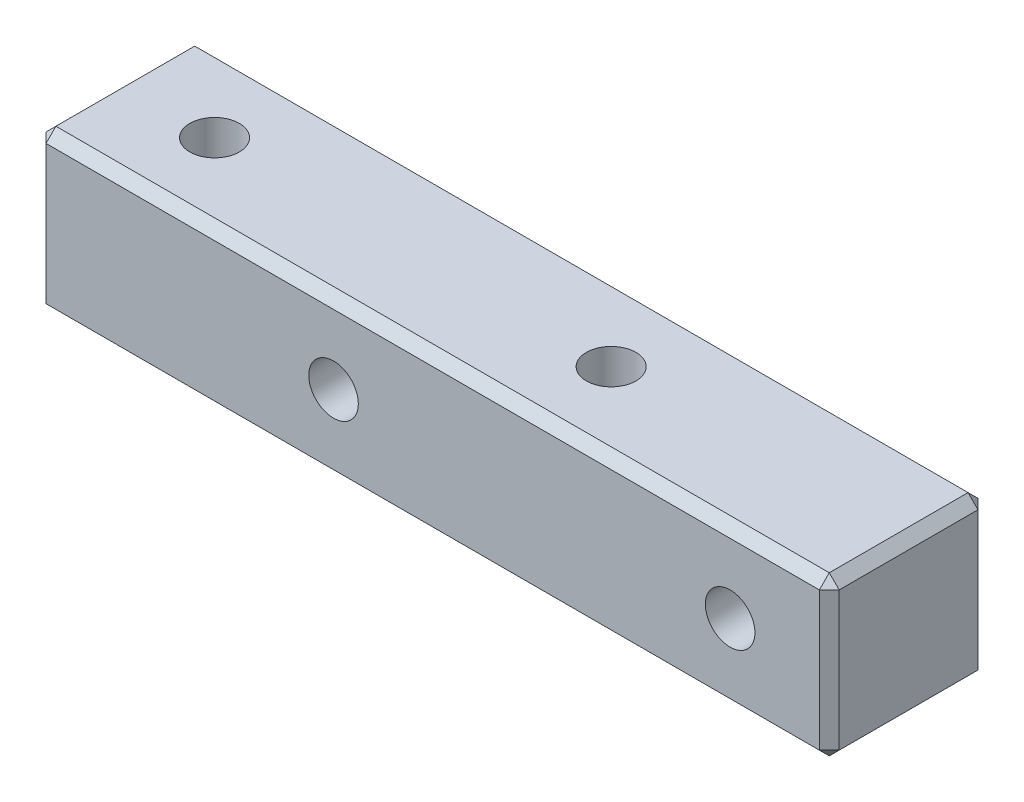
ISO-10303-21;
HEADER;
FILE_DESCRIPTION(('STEP AP214'),'2;1');
FILE_NAME('part.step','',(''),(''),'','','');
FILE_SCHEMA(('AUTOMOTIVE_DESIGN { 1 0 10303 214 1 1 1 1 }'));
ENDSEC;
DATA;
#1=APPLICATION_CONTEXT('core data for automotive mechanical design processes');
#2=APPLICATION_PROTOCOL_DEFINITION('international standard','automotive_design',2000,#1);
#3=PRODUCT_CONTEXT('',#1,'mechanical');
#4=PRODUCT('Part','Part','',(#3));
#5=PRODUCT_RELATED_PRODUCT_CATEGORY('part','',(#4));
#6=PRODUCT_DEFINITION_FORMATION('','',#4);
#7=PRODUCT_DEFINITION_CONTEXT('part definition',#1,'design');
#8=PRODUCT_DEFINITION('design','',#6,#7);
#9=PRODUCT_DEFINITION_SHAPE('','',#8);
#10=(LENGTH_UNIT() NAMED_UNIT(*) SI_UNIT(.MILLI.,.METRE.));
#11=(NAMED_UNIT(*) PLANE_ANGLE_UNIT() SI_UNIT($,.RADIAN.));
#12=(NAMED_UNIT(*) SI_UNIT($,.STERADIAN.) SOLID_ANGLE_UNIT());
#13=UNCERTAINTY_MEASURE_WITH_UNIT(LENGTH_MEASURE(1.E-05),#10,'distance_accuracy_value','');
#14=(GEOMETRIC_REPRESENTATION_CONTEXT(3) GLOBAL_UNCERTAINTY_ASSIGNED_CONTEXT((#13)) GLOBAL_UNIT_ASSIGNED_CONTEXT((#10,
#11,#12)) REPRESENTATION_CONTEXT('',''));
#15=CARTESIAN_POINT('',(0.,0.,0.));
#16=DIRECTION('',(0.,0.,1.));
#17=DIRECTION('',(1.,0.,0.));
#18=AXIS2_PLACEMENT_3D('',#15,#16,#17);
#19=CARTESIAN_POINT('',(0.,0.,-4.));
#20=DIRECTION('',(0.,0.,-1.));
#21=DIRECTION('',(-1.,0.,0.));
#22=AXIS2_PLACEMENT_3D('',#19,#20,#21);
#23=PLANE('',#22);
#24=DIRECTION('',(-1.,0.,0.));
#25=VECTOR('',#24,1.);
#26=CARTESIAN_POINT('',(-35.,-3.50000000000001,-4.));
#27=LINE('',#26,#25);
#28=CARTESIAN_POINT('',(4.5,-3.5,-4.));
#29=VERTEX_POINT('',#28);
#30=CARTESIAN_POINT('',(-34.5,-3.50000000000001,-4.));
#31=VERTEX_POINT('',#30);
#32=EDGE_CURVE('E197',#29,#31,#27,.T.);
#33=ORIENTED_EDGE('',*,*,#32,.T.);
#34=DIRECTION('',(0.,1.,0.));
#35=VECTOR('',#34,1.);
#36=CARTESIAN_POINT('',(-34.5,4.,-4.));
#37=LINE('',#36,#35);
#38=CARTESIAN_POINT('',(-34.5,3.5,-4.));
#39=VERTEX_POINT('',#38);
#40=EDGE_CURVE('E199',#31,#39,#37,.T.);
#41=ORIENTED_EDGE('',*,*,#40,.T.);
#42=DIRECTION('',(1.,0.,0.));
#43=VECTOR('',#42,1.);
#44=CARTESIAN_POINT('',(5.,3.5,-4.));
#45=LINE('',#44,#43);
#46=CARTESIAN_POINT('',(4.5,3.5,-4.));
#47=VERTEX_POINT('',#46);
#48=EDGE_CURVE('E193',#39,#47,#45,.T.);
#49=ORIENTED_EDGE('',*,*,#48,.T.);
#50=DIRECTION('',(0.,-1.,0.));
#51=VECTOR('',#50,1.);
#52=CARTESIAN_POINT('',(4.5,-4.,-4.));
#53=LINE('',#52,#51);
#54=EDGE_CURVE('E195',#47,#29,#53,.T.);
#55=ORIENTED_EDGE('',*,*,#54,.T.);
#56=EDGE_LOOP('',(#33,#41,#49,#55));
#57=FACE_BOUND('',#56,.T.);
#58=CARTESIAN_POINT('',(0.,0.,-4.));
#59=DIRECTION('',(0.,0.,1.));
#60=DIRECTION('',(1.,0.,0.));
#61=AXIS2_PLACEMENT_3D('',#58,#59,#60);
#62=CIRCLE('',#61,1.25);
#63=CARTESIAN_POINT('',(1.25,0.,-4.));
#64=VERTEX_POINT('',#63);
#65=EDGE_CURVE('E283',#64,#64,#62,.T.);
#66=ORIENTED_EDGE('',*,*,#65,.T.);
#67=EDGE_LOOP('',(#66));
#68=FACE_BOUND('',#67,.T.);
#69=CARTESIAN_POINT('',(-20.,0.,-4.));
#70=DIRECTION('',(0.,0.,1.));
#71=DIRECTION('',(1.,0.,0.));
#72=AXIS2_PLACEMENT_3D('',#69,#70,#71);
#73=CIRCLE('',#72,1.25);
#74=CARTESIAN_POINT('',(-18.75,0.,-4.));
#75=VERTEX_POINT('',#74);
#76=EDGE_CURVE('E158',#75,#75,#73,.T.);
#77=ORIENTED_EDGE('',*,*,#76,.T.);
#78=EDGE_LOOP('',(#77));
#79=FACE_BOUND('',#78,.T.);
#80=ADVANCED_FACE('F37',(#57,#68,#79),#23,.T.);
#81=CARTESIAN_POINT('',(0.,0.,4.));
#82=DIRECTION('',(0.,0.,-1.));
#83=DIRECTION('',(-1.,0.,0.));
#84=AXIS2_PLACEMENT_3D('',#81,#82,#83);
#85=PLANE('',#84);
#86=DIRECTION('',(-1.,0.,0.));
#87=VECTOR('',#86,1.);
#88=CARTESIAN_POINT('',(0.,3.5,4.));
#89=LINE('',#88,#87);
#90=CARTESIAN_POINT('',(4.5,3.5,4.));
#91=VERTEX_POINT('',#90);
#92=CARTESIAN_POINT('',(-34.5,3.5,4.));
#93=VERTEX_POINT('',#92);
#94=EDGE_CURVE('E175',#91,#93,#89,.T.);
#95=ORIENTED_EDGE('',*,*,#94,.T.);
#96=DIRECTION('',(0.,-1.,0.));
#97=VECTOR('',#96,1.);
#98=CARTESIAN_POINT('',(-34.5,0.,4.));
#99=LINE('',#98,#97);
#100=CARTESIAN_POINT('',(-34.5,-3.50000000000001,4.));
#101=VERTEX_POINT('',#100);
#102=EDGE_CURVE('E181',#93,#101,#99,.T.);
#103=ORIENTED_EDGE('',*,*,#102,.T.);
#104=DIRECTION('',(1.,0.,0.));
#105=VECTOR('',#104,1.);
#106=CARTESIAN_POINT('',(0.,-3.5,4.));
#107=LINE('',#106,#105);
#108=CARTESIAN_POINT('',(4.5,-3.5,4.));
#109=VERTEX_POINT('',#108);
#110=EDGE_CURVE('E179',#101,#109,#107,.T.);
#111=ORIENTED_EDGE('',*,*,#110,.T.);
#112=DIRECTION('',(0.,1.,0.));
#113=VECTOR('',#112,1.);
#114=CARTESIAN_POINT('',(4.5,0.,4.));
#115=LINE('',#114,#113);
#116=EDGE_CURVE('E177',#109,#91,#115,.T.);
#117=ORIENTED_EDGE('',*,*,#116,.T.);
#118=EDGE_LOOP('',(#95,#103,#111,#117));
#119=FACE_BOUND('',#118,.T.);
#120=CARTESIAN_POINT('',(0.,0.,4.));
#121=DIRECTION('',(0.,0.,1.));
#122=DIRECTION('',(1.,0.,0.));
#123=AXIS2_PLACEMENT_3D('',#120,#121,#122);
#124=CIRCLE('',#123,1.25);
#125=CARTESIAN_POINT('',(1.25,0.,4.));
#126=VERTEX_POINT('',#125);
#127=EDGE_CURVE('E280',#126,#126,#124,.T.);
#128=ORIENTED_EDGE('',*,*,#127,.F.);
#129=EDGE_LOOP('',(#128));
#130=FACE_BOUND('',#129,.T.);
#131=CARTESIAN_POINT('',(-20.,0.,4.));
#132=DIRECTION('',(0.,0.,1.));
#133=DIRECTION('',(1.,0.,0.));
#134=AXIS2_PLACEMENT_3D('',#131,#132,#133);
#135=CIRCLE('',#134,1.25);
#136=CARTESIAN_POINT('',(-18.75,0.,4.));
#137=VERTEX_POINT('',#136);
#138=EDGE_CURVE('E286',#137,#137,#135,.T.);
#139=ORIENTED_EDGE('',*,*,#138,.F.);
#140=EDGE_LOOP('',(#139));
#141=FACE_BOUND('',#140,.T.);
#142=ADVANCED_FACE('F343',(#119,#130,#141),#85,.F.);
#143=CARTESIAN_POINT('',(-35.,4.,4.));
#144=DIRECTION('',(0.,-1.,0.));
#145=DIRECTION('',(0.,0.,-1.));
#146=AXIS2_PLACEMENT_3D('',#143,#144,#145);
#147=PLANE('',#146);
#148=DIRECTION('',(-1.,0.,0.));
#149=VECTOR('',#148,1.);
#150=CARTESIAN_POINT('',(-35.,4.,-3.5));
#151=LINE('',#150,#149);
#152=CARTESIAN_POINT('',(4.5,4.,-3.5));
#153=VERTEX_POINT('',#152);
#154=CARTESIAN_POINT('',(-34.5,4.,-3.5));
#155=VERTEX_POINT('',#154);
#156=EDGE_CURVE('E172',#153,#155,#151,.T.);
#157=ORIENTED_EDGE('',*,*,#156,.T.);
#158=DIRECTION('',(0.,0.,1.));
#159=VECTOR('',#158,1.);
#160=CARTESIAN_POINT('',(-34.5,4.,4.));
#161=LINE('',#160,#159);
#162=CARTESIAN_POINT('',(-34.5,4.,3.5));
#163=VERTEX_POINT('',#162);
#164=EDGE_CURVE('E135',#155,#163,#161,.T.);
#165=ORIENTED_EDGE('',*,*,#164,.T.);
#166=DIRECTION('',(1.,0.,0.));
#167=VECTOR('',#166,1.);
#168=CARTESIAN_POINT('',(-35.,4.,3.5));
#169=LINE('',#168,#167);
#170=CARTESIAN_POINT('',(4.5,4.,3.5));
#171=VERTEX_POINT('',#170);
#172=EDGE_CURVE('E164',#163,#171,#169,.T.);
#173=ORIENTED_EDGE('',*,*,#172,.T.);
#174=DIRECTION('',(0.,0.,-1.));
#175=VECTOR('',#174,1.);
#176=CARTESIAN_POINT('',(4.5,4.,4.));
#177=LINE('',#176,#175);
#178=EDGE_CURVE('E166',#171,#153,#177,.T.);
#179=ORIENTED_EDGE('',*,*,#178,.T.);
#180=EDGE_LOOP('',(#157,#165,#173,#179));
#181=FACE_BOUND('',#180,.T.);
#182=CARTESIAN_POINT('',(-10.,4.,0.));
#183=DIRECTION('',(0.,1.,0.));
#184=DIRECTION('',(0.,0.,1.));
#185=AXIS2_PLACEMENT_3D('',#182,#183,#184);
#186=CIRCLE('',#185,1.25);
#187=CARTESIAN_POINT('',(-10.,4.,1.25));
#188=VERTEX_POINT('',#187);
#189=EDGE_CURVE('E261',#188,#188,#186,.T.);
#190=ORIENTED_EDGE('',*,*,#189,.F.);
#191=EDGE_LOOP('',(#190));
#192=FACE_BOUND('',#191,.T.);
#193=CARTESIAN_POINT('',(-30.,4.,0.));
#194=DIRECTION('',(0.,1.,0.));
#195=DIRECTION('',(0.,0.,1.));
#196=AXIS2_PLACEMENT_3D('',#193,#194,#195);
#197=CIRCLE('',#196,1.25);
#198=CARTESIAN_POINT('',(-30.,4.,1.25));
#199=VERTEX_POINT('',#198);
#200=EDGE_CURVE('E272',#199,#199,#197,.T.);
#201=ORIENTED_EDGE('',*,*,#200,.F.);
#202=EDGE_LOOP('',(#201));
#203=FACE_BOUND('',#202,.T.);
#204=ADVANCED_FACE('F314',(#181,#192,#203),#147,.F.);
#205=CARTESIAN_POINT('',(-35.,4.,4.));
#206=DIRECTION('',(1.,0.,0.));
#207=DIRECTION('',(0.,0.,-1.));
#208=AXIS2_PLACEMENT_3D('',#205,#206,#207);
#209=PLANE('',#208);
#210=DIRECTION('',(0.,1.,0.));
#211=VECTOR('',#210,1.);
#212=CARTESIAN_POINT('',(-35.,4.,3.5));
#213=LINE('',#212,#211);
#214=CARTESIAN_POINT('',(-35.,-3.50000000000001,3.5));
#215=VERTEX_POINT('',#214);
#216=CARTESIAN_POINT('',(-35.,3.5,3.5));
#217=VERTEX_POINT('',#216);
#218=EDGE_CURVE('E162',#215,#217,#213,.T.);
#219=ORIENTED_EDGE('',*,*,#218,.T.);
#220=DIRECTION('',(0.,0.,-1.));
#221=VECTOR('',#220,1.);
#222=CARTESIAN_POINT('',(-35.,3.5,4.));
#223=LINE('',#222,#221);
#224=CARTESIAN_POINT('',(-35.,3.5,-3.5));
#225=VERTEX_POINT('',#224);
#226=EDGE_CURVE('E133',#217,#225,#223,.T.);
#227=ORIENTED_EDGE('',*,*,#226,.T.);
#228=DIRECTION('',(0.,-1.,0.));
#229=VECTOR('',#228,1.);
#230=CARTESIAN_POINT('',(-35.,-4.,-3.5));
#231=LINE('',#230,#229);
#232=CARTESIAN_POINT('',(-35.,-3.50000000000001,-3.5));
#233=VERTEX_POINT('',#232);
#234=EDGE_CURVE('E151',#225,#233,#231,.T.);
#235=ORIENTED_EDGE('',*,*,#234,.T.);
#236=DIRECTION('',(0.,0.,1.));
#237=VECTOR('',#236,1.);
#238=CARTESIAN_POINT('',(-35.,-3.50000000000001,4.));
#239=LINE('',#238,#237);
#240=EDGE_CURVE('E157',#233,#215,#239,.T.);
#241=ORIENTED_EDGE('',*,*,#240,.T.);
#242=EDGE_LOOP('',(#219,#227,#235,#241));
#243=FACE_BOUND('',#242,.T.);
#244=ADVANCED_FACE('F160',(#243),#209,.F.);
#245=CARTESIAN_POINT('',(5.,-4.,4.));
#246=DIRECTION('',(0.,1.,0.));
#247=DIRECTION('',(-1.,0.,0.));
#248=AXIS2_PLACEMENT_3D('',#245,#246,#247);
#249=PLANE('',#248);
#250=DIRECTION('',(0.,0.,1.));
#251=VECTOR('',#250,1.);
#252=CARTESIAN_POINT('',(4.5,-4.,4.));
#253=LINE('',#252,#251);
#254=CARTESIAN_POINT('',(4.5,-4.,-3.5));
#255=VERTEX_POINT('',#254);
#256=CARTESIAN_POINT('',(4.5,-4.,3.5));
#257=VERTEX_POINT('',#256);
#258=EDGE_CURVE('E186',#255,#257,#253,.T.);
#259=ORIENTED_EDGE('',*,*,#258,.T.);
#260=DIRECTION('',(-1.,0.,0.));
#261=VECTOR('',#260,1.);
#262=CARTESIAN_POINT('',(5.,-4.,3.5));
#263=LINE('',#262,#261);
#264=CARTESIAN_POINT('',(-34.5,-4.,3.5));
#265=VERTEX_POINT('',#264);
#266=EDGE_CURVE('E191',#257,#265,#263,.T.);
#267=ORIENTED_EDGE('',*,*,#266,.T.);
#268=DIRECTION('',(0.,0.,-1.));
#269=VECTOR('',#268,1.);
#270=CARTESIAN_POINT('',(-34.5,-4.,4.));
#271=LINE('',#270,#269);
#272=CARTESIAN_POINT('',(-34.5,-4.,-3.5));
#273=VERTEX_POINT('',#272);
#274=EDGE_CURVE('E188',#265,#273,#271,.T.);
#275=ORIENTED_EDGE('',*,*,#274,.T.);
#276=DIRECTION('',(1.,0.,0.));
#277=VECTOR('',#276,1.);
#278=CARTESIAN_POINT('',(5.,-4.,-3.5));
#279=LINE('',#278,#277);
#280=EDGE_CURVE('E184',#273,#255,#279,.T.);
#281=ORIENTED_EDGE('',*,*,#280,.T.);
#282=EDGE_LOOP('',(#259,#267,#275,#281));
#283=FACE_BOUND('',#282,.T.);
#284=CARTESIAN_POINT('',(-10.,-4.,0.));
#285=DIRECTION('',(0.,1.,0.));
#286=DIRECTION('',(0.,0.,1.));
#287=AXIS2_PLACEMENT_3D('',#284,#285,#286);
#288=CIRCLE('',#287,1.24999999999999);
#289=CARTESIAN_POINT('',(-10.,-4.,1.24999999999999));
#290=VERTEX_POINT('',#289);
#291=EDGE_CURVE('E267',#290,#290,#288,.T.);
#292=ORIENTED_EDGE('',*,*,#291,.T.);
#293=EDGE_LOOP('',(#292));
#294=FACE_BOUND('',#293,.T.);
#295=CARTESIAN_POINT('',(-30.,-4.,0.));
#296=DIRECTION('',(0.,1.,0.));
#297=DIRECTION('',(0.,0.,1.));
#298=AXIS2_PLACEMENT_3D('',#295,#296,#297);
#299=CIRCLE('',#298,1.24999999999999);
#300=CARTESIAN_POINT('',(-30.,-4.,1.24999999999999));
#301=VERTEX_POINT('',#300);
#302=EDGE_CURVE('E277',#301,#301,#299,.T.);
#303=ORIENTED_EDGE('',*,*,#302,.T.);
#304=EDGE_LOOP('',(#303));
#305=FACE_BOUND('',#304,.T.);
#306=ADVANCED_FACE('F356',(#283,#294,#305),#249,.F.);
#307=CARTESIAN_POINT('',(5.,4.,4.));
#308=DIRECTION('',(-1.,0.,0.));
#309=DIRECTION('',(0.,-1.,0.));
#310=AXIS2_PLACEMENT_3D('',#307,#308,#309);
#311=PLANE('',#310);
#312=DIRECTION('',(0.,-1.,0.));
#313=VECTOR('',#312,1.);
#314=CARTESIAN_POINT('',(5.,4.,3.5));
#315=LINE('',#314,#313);
#316=CARTESIAN_POINT('',(5.,3.5,3.5));
#317=VERTEX_POINT('',#316);
#318=CARTESIAN_POINT('',(5.,-3.5,3.5));
#319=VERTEX_POINT('',#318);
#320=EDGE_CURVE('E46',#317,#319,#315,.T.);
#321=ORIENTED_EDGE('',*,*,#320,.T.);
#322=DIRECTION('',(0.,0.,-1.));
#323=VECTOR('',#322,1.);
#324=CARTESIAN_POINT('',(5.,-3.5,4.));
#325=LINE('',#324,#323);
#326=CARTESIAN_POINT('',(5.,-3.5,-3.5));
#327=VERTEX_POINT('',#326);
#328=EDGE_CURVE('E11',#319,#327,#325,.T.);
#329=ORIENTED_EDGE('',*,*,#328,.T.);
#330=DIRECTION('',(0.,1.,0.));
#331=VECTOR('',#330,1.);
#332=CARTESIAN_POINT('',(5.,4.,-3.5));
#333=LINE('',#332,#331);
#334=CARTESIAN_POINT('',(5.,3.5,-3.5));
#335=VERTEX_POINT('',#334);
#336=EDGE_CURVE('E60',#327,#335,#333,.T.);
#337=ORIENTED_EDGE('',*,*,#336,.T.);
#338=DIRECTION('',(0.,0.,1.));
#339=VECTOR('',#338,1.);
#340=CARTESIAN_POINT('',(5.,3.5,4.));
#341=LINE('',#340,#339);
#342=EDGE_CURVE('E202',#335,#317,#341,.T.);
#343=ORIENTED_EDGE('',*,*,#342,.T.);
#344=EDGE_LOOP('',(#321,#329,#337,#343));
#345=FACE_BOUND('',#344,.T.);
#346=ADVANCED_FACE('F352',(#345),#311,.F.);
#347=CARTESIAN_POINT('',(-20.,0.,4.));
#348=DIRECTION('',(0.,0.,1.));
#349=DIRECTION('',(1.,0.,0.));
#350=AXIS2_PLACEMENT_3D('',#347,#348,#349);
#351=CYLINDRICAL_SURFACE('',#350,1.25);
#352=ORIENTED_EDGE('',*,*,#76,.F.);
#353=EDGE_LOOP('',(#352));
#354=FACE_BOUND('',#353,.T.);
#355=ORIENTED_EDGE('',*,*,#138,.T.);
#356=EDGE_LOOP('',(#355));
#357=FACE_BOUND('',#356,.T.);
#358=ADVANCED_FACE('F355',(#354,#357),#351,.F.);
#359=CARTESIAN_POINT('',(0.,0.,4.));
#360=DIRECTION('',(0.,0.,1.));
#361=DIRECTION('',(1.,0.,0.));
#362=AXIS2_PLACEMENT_3D('',#359,#360,#361);
#363=CYLINDRICAL_SURFACE('',#362,1.25);
#364=ORIENTED_EDGE('',*,*,#65,.F.);
#365=EDGE_LOOP('',(#364));
#366=FACE_BOUND('',#365,.T.);
#367=ORIENTED_EDGE('',*,*,#127,.T.);
#368=EDGE_LOOP('',(#367));
#369=FACE_BOUND('',#368,.T.);
#370=ADVANCED_FACE('F531',(#366,#369),#363,.F.);
#371=CARTESIAN_POINT('',(-30.,4.,0.));
#372=DIRECTION('',(0.,1.,0.));
#373=DIRECTION('',(0.,0.,1.));
#374=AXIS2_PLACEMENT_3D('',#371,#372,#373);
#375=CYLINDRICAL_SURFACE('',#374,1.25);
#376=ORIENTED_EDGE('',*,*,#302,.F.);
#377=EDGE_LOOP('',(#376));
#378=FACE_BOUND('',#377,.T.);
#379=ORIENTED_EDGE('',*,*,#200,.T.);
#380=EDGE_LOOP('',(#379));
#381=FACE_BOUND('',#380,.T.);
#382=ADVANCED_FACE('F521',(#378,#381),#375,.F.);
#383=CARTESIAN_POINT('',(-10.,4.,0.));
#384=DIRECTION('',(0.,1.,0.));
#385=DIRECTION('',(0.,0.,1.));
#386=AXIS2_PLACEMENT_3D('',#383,#384,#385);
#387=CYLINDRICAL_SURFACE('',#386,1.25);
#388=ORIENTED_EDGE('',*,*,#291,.F.);
#389=EDGE_LOOP('',(#388));
#390=FACE_BOUND('',#389,.T.);
#391=ORIENTED_EDGE('',*,*,#189,.T.);
#392=EDGE_LOOP('',(#391));
#393=FACE_BOUND('',#392,.T.);
#394=ADVANCED_FACE('F512',(#390,#393),#387,.F.);
#395=CARTESIAN_POINT('',(5.,-3.5,4.));
#396=DIRECTION('',(-0.707106781186547,0.707106781186547,0.));
#397=DIRECTION('',(0.,0.,-1.));
#398=AXIS2_PLACEMENT_3D('',#395,#396,#397);
#399=PLANE('',#398);
#400=DIRECTION('',(-0.707106781186547,-0.707106781186547,0.));
#401=VECTOR('',#400,1.);
#402=CARTESIAN_POINT('',(4.5,-4.,3.5));
#403=LINE('',#402,#401);
#404=EDGE_CURVE('E41',#257,#319,#403,.F.);
#405=ORIENTED_EDGE('',*,*,#404,.F.);
#406=ORIENTED_EDGE('',*,*,#258,.F.);
#407=DIRECTION('',(0.707106781186548,0.707106781186548,0.));
#408=VECTOR('',#407,1.);
#409=CARTESIAN_POINT('',(5.,-3.5,-3.5));
#410=LINE('',#409,#408);
#411=EDGE_CURVE('E255',#327,#255,#410,.F.);
#412=ORIENTED_EDGE('',*,*,#411,.F.);
#413=ORIENTED_EDGE('',*,*,#328,.F.);
#414=EDGE_LOOP('',(#405,#406,#412,#413));
#415=FACE_BOUND('',#414,.T.);
#416=ADVANCED_FACE('F39',(#415),#399,.F.);
#417=CARTESIAN_POINT('',(4.5,-4.,3.5));
#418=DIRECTION('',(0.577350269189626,-0.577350269189626,0.577350269189626));
#419=DIRECTION('',(0.707106781186547,0.,-0.707106781186547));
#420=AXIS2_PLACEMENT_3D('',#417,#418,#419);
#421=PLANE('',#420);
#422=DIRECTION('',(0.,0.707106781186547,0.707106781186547));
#423=VECTOR('',#422,1.);
#424=CARTESIAN_POINT('',(4.5,-4.,3.5));
#425=LINE('',#424,#423);
#426=EDGE_CURVE('E250',#257,#109,#425,.T.);
#427=ORIENTED_EDGE('',*,*,#426,.F.);
#428=ORIENTED_EDGE('',*,*,#404,.T.);
#429=DIRECTION('',(0.707106781186548,0.,-0.707106781186547));
#430=VECTOR('',#429,1.);
#431=CARTESIAN_POINT('',(4.75,-3.5,3.75));
#432=LINE('',#431,#430);
#433=EDGE_CURVE('E253',#109,#319,#432,.T.);
#434=ORIENTED_EDGE('',*,*,#433,.F.);
#435=EDGE_LOOP('',(#427,#428,#434));
#436=FACE_BOUND('',#435,.T.);
#437=ADVANCED_FACE('F498',(#436),#421,.T.);
#438=CARTESIAN_POINT('',(5.,-3.5,-3.5));
#439=DIRECTION('',(0.577350269189626,-0.577350269189626,-0.577350269189626));
#440=DIRECTION('',(-0.707106781186548,0.,-0.707106781186547));
#441=AXIS2_PLACEMENT_3D('',#438,#439,#440);
#442=PLANE('',#441);
#443=DIRECTION('',(0.707106781186548,0.,0.707106781186547));
#444=VECTOR('',#443,1.);
#445=CARTESIAN_POINT('',(5.,-3.5,-3.5));
#446=LINE('',#445,#444);
#447=EDGE_CURVE('E245',#327,#29,#446,.F.);
#448=ORIENTED_EDGE('',*,*,#447,.F.);
#449=ORIENTED_EDGE('',*,*,#411,.T.);
#450=DIRECTION('',(0.,0.707106781186547,-0.707106781186547));
#451=VECTOR('',#450,1.);
#452=CARTESIAN_POINT('',(4.5,-3.75,-3.75));
#453=LINE('',#452,#451);
#454=EDGE_CURVE('E247',#29,#255,#453,.F.);
#455=ORIENTED_EDGE('',*,*,#454,.F.);
#456=EDGE_LOOP('',(#448,#449,#455));
#457=FACE_BOUND('',#456,.T.);
#458=ADVANCED_FACE('F489',(#457),#442,.T.);
#459=CARTESIAN_POINT('',(4.5,0.,4.));
#460=DIRECTION('',(-0.707106781186547,0.,-0.707106781186548));
#461=DIRECTION('',(0.,1.,0.));
#462=AXIS2_PLACEMENT_3D('',#459,#460,#461);
#463=PLANE('',#462);
#464=ORIENTED_EDGE('',*,*,#433,.T.);
#465=ORIENTED_EDGE('',*,*,#320,.F.);
#466=DIRECTION('',(-0.707106781186548,0.,0.707106781186547));
#467=VECTOR('',#466,1.);
#468=CARTESIAN_POINT('',(4.5,3.5,4.));
#469=LINE('',#468,#467);
#470=EDGE_CURVE('E239',#91,#317,#469,.F.);
#471=ORIENTED_EDGE('',*,*,#470,.F.);
#472=ORIENTED_EDGE('',*,*,#116,.F.);
#473=EDGE_LOOP('',(#464,#465,#471,#472));
#474=FACE_BOUND('',#473,.T.);
#475=ADVANCED_FACE('F480',(#474),#463,.F.);
#476=CARTESIAN_POINT('',(0.,-3.5,4.));
#477=DIRECTION('',(0.,0.707106781186547,-0.707106781186547));
#478=DIRECTION('',(1.,0.,0.));
#479=AXIS2_PLACEMENT_3D('',#476,#477,#478);
#480=PLANE('',#479);
#481=ORIENTED_EDGE('',*,*,#426,.T.);
#482=ORIENTED_EDGE('',*,*,#110,.F.);
#483=DIRECTION('',(0.,-0.707106781186548,-0.707106781186548));
#484=VECTOR('',#483,1.);
#485=CARTESIAN_POINT('',(-34.5,-3.50000000000001,4.));
#486=LINE('',#485,#484);
#487=EDGE_CURVE('E236',#265,#101,#486,.F.);
#488=ORIENTED_EDGE('',*,*,#487,.F.);
#489=ORIENTED_EDGE('',*,*,#266,.F.);
#490=EDGE_LOOP('',(#481,#482,#488,#489));
#491=FACE_BOUND('',#490,.T.);
#492=ADVANCED_FACE('F472',(#491),#480,.F.);
#493=CARTESIAN_POINT('',(-34.5,-4.,4.));
#494=DIRECTION('',(0.707106781186545,0.70710678118655,0.));
#495=DIRECTION('',(0.,0.,-1.));
#496=AXIS2_PLACEMENT_3D('',#493,#494,#495);
#497=PLANE('',#496);
#498=DIRECTION('',(0.70710678118655,-0.707106781186545,0.));
#499=VECTOR('',#498,1.);
#500=CARTESIAN_POINT('',(-34.5,-4.,-3.5));
#501=LINE('',#500,#499);
#502=EDGE_CURVE('E230',#273,#233,#501,.F.);
#503=ORIENTED_EDGE('',*,*,#502,.F.);
#504=ORIENTED_EDGE('',*,*,#274,.F.);
#505=DIRECTION('',(-0.70710678118655,0.707106781186545,0.));
#506=VECTOR('',#505,1.);
#507=CARTESIAN_POINT('',(-34.75,-3.75000000000001,3.5));
#508=LINE('',#507,#506);
#509=EDGE_CURVE('E233',#215,#265,#508,.F.);
#510=ORIENTED_EDGE('',*,*,#509,.F.);
#511=ORIENTED_EDGE('',*,*,#240,.F.);
#512=EDGE_LOOP('',(#503,#504,#510,#511));
#513=FACE_BOUND('',#512,.T.);
#514=ADVANCED_FACE('F295',(#513),#497,.F.);
#515=CARTESIAN_POINT('',(5.,-4.,-3.5));
#516=DIRECTION('',(0.,-0.707106781186547,-0.707106781186547));
#517=DIRECTION('',(-1.,0.,0.));
#518=AXIS2_PLACEMENT_3D('',#515,#516,#517);
#519=PLANE('',#518);
#520=ORIENTED_EDGE('',*,*,#454,.T.);
#521=ORIENTED_EDGE('',*,*,#280,.F.);
#522=DIRECTION('',(0.,-0.707106781186548,0.707106781186548));
#523=VECTOR('',#522,1.);
#524=CARTESIAN_POINT('',(-34.5,-4.,-3.5));
#525=LINE('',#524,#523);
#526=EDGE_CURVE('E228',#31,#273,#525,.T.);
#527=ORIENTED_EDGE('',*,*,#526,.F.);
#528=ORIENTED_EDGE('',*,*,#32,.F.);
#529=EDGE_LOOP('',(#520,#521,#527,#528));
#530=FACE_BOUND('',#529,.T.);
#531=ADVANCED_FACE('F328',(#530),#519,.T.);
#532=CARTESIAN_POINT('',(5.,4.,-3.5));
#533=DIRECTION('',(0.707106781186547,0.,-0.707106781186548));
#534=DIRECTION('',(0.,-1.,0.));
#535=AXIS2_PLACEMENT_3D('',#532,#533,#534);
#536=PLANE('',#535);
#537=ORIENTED_EDGE('',*,*,#447,.T.);
#538=ORIENTED_EDGE('',*,*,#54,.F.);
#539=DIRECTION('',(-0.707106781186548,0.,-0.707106781186547));
#540=VECTOR('',#539,1.);
#541=CARTESIAN_POINT('',(5.,3.5,-3.5));
#542=LINE('',#541,#540);
#543=EDGE_CURVE('E225',#335,#47,#542,.T.);
#544=ORIENTED_EDGE('',*,*,#543,.F.);
#545=ORIENTED_EDGE('',*,*,#336,.F.);
#546=EDGE_LOOP('',(#537,#538,#544,#545));
#547=FACE_BOUND('',#546,.T.);
#548=ADVANCED_FACE('F449',(#547),#536,.T.);
#549=CARTESIAN_POINT('',(4.5,4.,4.));
#550=DIRECTION('',(-0.70710678118655,-0.707106781186545,0.));
#551=DIRECTION('',(0.,0.,-1.));
#552=AXIS2_PLACEMENT_3D('',#549,#550,#551);
#553=PLANE('',#552);
#554=DIRECTION('',(0.707106781186545,-0.70710678118655,0.));
#555=VECTOR('',#554,1.);
#556=CARTESIAN_POINT('',(4.75,3.75,3.5));
#557=LINE('',#556,#555);
#558=EDGE_CURVE('E242',#317,#171,#557,.F.);
#559=ORIENTED_EDGE('',*,*,#558,.F.);
#560=ORIENTED_EDGE('',*,*,#342,.F.);
#561=DIRECTION('',(-0.707106781186545,0.70710678118655,0.));
#562=VECTOR('',#561,1.);
#563=CARTESIAN_POINT('',(5.,3.5,-3.5));
#564=LINE('',#563,#562);
#565=EDGE_CURVE('E222',#153,#335,#564,.F.);
#566=ORIENTED_EDGE('',*,*,#565,.F.);
#567=ORIENTED_EDGE('',*,*,#178,.F.);
#568=EDGE_LOOP('',(#559,#560,#566,#567));
#569=FACE_BOUND('',#568,.T.);
#570=ADVANCED_FACE('F440',(#569),#553,.F.);
#571=CARTESIAN_POINT('',(4.5,3.5,4.));
#572=DIRECTION('',(0.577350269189627,0.577350269189623,0.577350269189627));
#573=DIRECTION('',(0.707106781186548,0.,-0.707106781186548));
#574=AXIS2_PLACEMENT_3D('',#571,#572,#573);
#575=PLANE('',#574);
#576=ORIENTED_EDGE('',*,*,#470,.T.);
#577=ORIENTED_EDGE('',*,*,#558,.T.);
#578=DIRECTION('',(0.,0.707106781186548,-0.707106781186548));
#579=VECTOR('',#578,1.);
#580=CARTESIAN_POINT('',(4.5,3.5,4.));
#581=LINE('',#580,#579);
#582=EDGE_CURVE('E219',#91,#171,#581,.T.);
#583=ORIENTED_EDGE('',*,*,#582,.F.);
#584=EDGE_LOOP('',(#576,#577,#583));
#585=FACE_BOUND('',#584,.T.);
#586=ADVANCED_FACE('F340',(#585),#575,.T.);
#587=CARTESIAN_POINT('',(-34.5,-3.50000000000001,4.));
#588=DIRECTION('',(-0.577350269189623,-0.577350269189627,0.577350269189627));
#589=DIRECTION('',(0.,-0.707106781186547,-0.707106781186547));
#590=AXIS2_PLACEMENT_3D('',#587,#588,#589);
#591=PLANE('',#590);
#592=ORIENTED_EDGE('',*,*,#509,.T.);
#593=ORIENTED_EDGE('',*,*,#487,.T.);
#594=DIRECTION('',(0.70710678118655,0.,0.707106781186545));
#595=VECTOR('',#594,1.);
#596=CARTESIAN_POINT('',(-34.5,-3.50000000000001,4.));
#597=LINE('',#596,#595);
#598=EDGE_CURVE('E217',#215,#101,#597,.T.);
#599=ORIENTED_EDGE('',*,*,#598,.F.);
#600=EDGE_LOOP('',(#592,#593,#599));
#601=FACE_BOUND('',#600,.T.);
#602=ADVANCED_FACE('F298',(#601),#591,.T.);
#603=CARTESIAN_POINT('',(-34.5,-4.,-3.5));
#604=DIRECTION('',(-0.577350269189623,-0.577350269189627,-0.577350269189627));
#605=DIRECTION('',(0.,0.707106781186547,-0.707106781186547));
#606=AXIS2_PLACEMENT_3D('',#603,#604,#605);
#607=PLANE('',#606);
#608=ORIENTED_EDGE('',*,*,#526,.T.);
#609=ORIENTED_EDGE('',*,*,#502,.T.);
#610=DIRECTION('',(0.70710678118655,0.,-0.707106781186545));
#611=VECTOR('',#610,1.);
#612=CARTESIAN_POINT('',(-34.75,-3.50000000000001,-3.75));
#613=LINE('',#612,#611);
#614=EDGE_CURVE('E154',#31,#233,#613,.F.);
#615=ORIENTED_EDGE('',*,*,#614,.F.);
#616=EDGE_LOOP('',(#608,#609,#615));
#617=FACE_BOUND('',#616,.T.);
#618=ADVANCED_FACE('F330',(#617),#607,.T.);
#619=CARTESIAN_POINT('',(5.,3.5,-3.5));
#620=DIRECTION('',(0.577350269189627,0.577350269189623,-0.577350269189628));
#621=DIRECTION('',(-0.707106781186548,0.,-0.707106781186547));
#622=AXIS2_PLACEMENT_3D('',#619,#620,#621);
#623=PLANE('',#622);
#624=ORIENTED_EDGE('',*,*,#565,.T.);
#625=ORIENTED_EDGE('',*,*,#543,.T.);
#626=DIRECTION('',(0.,0.707106781186547,0.707106781186547));
#627=VECTOR('',#626,1.);
#628=CARTESIAN_POINT('',(4.5,3.75,-3.75));
#629=LINE('',#628,#627);
#630=EDGE_CURVE('E213',#153,#47,#629,.F.);
#631=ORIENTED_EDGE('',*,*,#630,.F.);
#632=EDGE_LOOP('',(#624,#625,#631));
#633=FACE_BOUND('',#632,.T.);
#634=ADVANCED_FACE('F332',(#633),#623,.T.);
#635=CARTESIAN_POINT('',(0.,3.5,4.));
#636=DIRECTION('',(0.,-0.707106781186547,-0.707106781186547));
#637=DIRECTION('',(-1.,0.,0.));
#638=AXIS2_PLACEMENT_3D('',#635,#636,#637);
#639=PLANE('',#638);
#640=ORIENTED_EDGE('',*,*,#582,.T.);
#641=ORIENTED_EDGE('',*,*,#172,.F.);
#642=DIRECTION('',(0.,-0.707106781186548,0.707106781186548));
#643=VECTOR('',#642,1.);
#644=CARTESIAN_POINT('',(-34.5,4.,3.5));
#645=LINE('',#644,#643);
#646=EDGE_CURVE('E210',#93,#163,#645,.F.);
#647=ORIENTED_EDGE('',*,*,#646,.F.);
#648=ORIENTED_EDGE('',*,*,#94,.F.);
#649=EDGE_LOOP('',(#640,#641,#647,#648));
#650=FACE_BOUND('',#649,.T.);
#651=ADVANCED_FACE('F310',(#650),#639,.F.);
#652=CARTESIAN_POINT('',(-34.5,0.,4.));
#653=DIRECTION('',(0.707106781186545,0.,-0.70710678118655));
#654=DIRECTION('',(0.,-1.,0.));
#655=AXIS2_PLACEMENT_3D('',#652,#653,#654);
#656=PLANE('',#655);
#657=ORIENTED_EDGE('',*,*,#598,.T.);
#658=ORIENTED_EDGE('',*,*,#102,.F.);
#659=DIRECTION('',(-0.70710678118655,0.,-0.707106781186545));
#660=VECTOR('',#659,1.);
#661=CARTESIAN_POINT('',(-34.75,3.5,3.75));
#662=LINE('',#661,#660);
#663=EDGE_CURVE('E148',#217,#93,#662,.F.);
#664=ORIENTED_EDGE('',*,*,#663,.F.);
#665=ORIENTED_EDGE('',*,*,#218,.F.);
#666=EDGE_LOOP('',(#657,#658,#664,#665));
#667=FACE_BOUND('',#666,.T.);
#668=ADVANCED_FACE('F302',(#667),#656,.F.);
#669=CARTESIAN_POINT('',(-35.,4.,-3.5));
#670=DIRECTION('',(-0.707106781186545,0.,-0.70710678118655));
#671=DIRECTION('',(0.,1.,0.));
#672=AXIS2_PLACEMENT_3D('',#669,#670,#671);
#673=PLANE('',#672);
#674=ORIENTED_EDGE('',*,*,#614,.T.);
#675=ORIENTED_EDGE('',*,*,#234,.F.);
#676=DIRECTION('',(-0.70710678118655,0.,0.707106781186545));
#677=VECTOR('',#676,1.);
#678=CARTESIAN_POINT('',(-35.,3.5,-3.5));
#679=LINE('',#678,#677);
#680=EDGE_CURVE('E140',#39,#225,#679,.T.);
#681=ORIENTED_EDGE('',*,*,#680,.F.);
#682=ORIENTED_EDGE('',*,*,#40,.F.);
#683=EDGE_LOOP('',(#674,#675,#681,#682));
#684=FACE_BOUND('',#683,.T.);
#685=ADVANCED_FACE('F152',(#684),#673,.T.);
#686=CARTESIAN_POINT('',(-35.,4.,-3.5));
#687=DIRECTION('',(0.,0.707106781186547,-0.707106781186547));
#688=DIRECTION('',(1.,0.,0.));
#689=AXIS2_PLACEMENT_3D('',#686,#687,#688);
#690=PLANE('',#689);
#691=ORIENTED_EDGE('',*,*,#630,.T.);
#692=ORIENTED_EDGE('',*,*,#48,.F.);
#693=DIRECTION('',(0.,-0.707106781186548,-0.707106781186548));
#694=VECTOR('',#693,1.);
#695=CARTESIAN_POINT('',(-34.5,3.75,-3.75));
#696=LINE('',#695,#694);
#697=EDGE_CURVE('E144',#155,#39,#696,.T.);
#698=ORIENTED_EDGE('',*,*,#697,.F.);
#699=ORIENTED_EDGE('',*,*,#156,.F.);
#700=EDGE_LOOP('',(#691,#692,#698,#699));
#701=FACE_BOUND('',#700,.T.);
#702=ADVANCED_FACE('F319',(#701),#690,.T.);
#703=CARTESIAN_POINT('',(-34.5,4.,3.5));
#704=DIRECTION('',(-0.577350269189623,0.577350269189627,0.577350269189627));
#705=DIRECTION('',(0.,-0.707106781186547,0.707106781186547));
#706=AXIS2_PLACEMENT_3D('',#703,#704,#705);
#707=PLANE('',#706);
#708=ORIENTED_EDGE('',*,*,#663,.T.);
#709=ORIENTED_EDGE('',*,*,#646,.T.);
#710=DIRECTION('',(0.70710678118655,0.707106781186545,0.));
#711=VECTOR('',#710,1.);
#712=CARTESIAN_POINT('',(-34.5,4.,3.5));
#713=LINE('',#712,#711);
#714=EDGE_CURVE('E137',#217,#163,#713,.T.);
#715=ORIENTED_EDGE('',*,*,#714,.F.);
#716=EDGE_LOOP('',(#708,#709,#715));
#717=FACE_BOUND('',#716,.T.);
#718=ADVANCED_FACE('F306',(#717),#707,.T.);
#719=CARTESIAN_POINT('',(-35.,3.5,-3.5));
#720=DIRECTION('',(-0.577350269189623,0.577350269189627,-0.577350269189627));
#721=DIRECTION('',(0.,0.707106781186547,0.707106781186547));
#722=AXIS2_PLACEMENT_3D('',#719,#720,#721);
#723=PLANE('',#722);
#724=ORIENTED_EDGE('',*,*,#697,.T.);
#725=ORIENTED_EDGE('',*,*,#680,.T.);
#726=DIRECTION('',(-0.70710678118655,-0.707106781186545,0.));
#727=VECTOR('',#726,1.);
#728=CARTESIAN_POINT('',(-35.,3.5,-3.5));
#729=LINE('',#728,#727);
#730=EDGE_CURVE('E129',#155,#225,#729,.T.);
#731=ORIENTED_EDGE('',*,*,#730,.F.);
#732=EDGE_LOOP('',(#724,#725,#731));
#733=FACE_BOUND('',#732,.T.);
#734=ADVANCED_FACE('F142',(#733),#723,.T.);
#735=CARTESIAN_POINT('',(-35.,3.5,4.));
#736=DIRECTION('',(0.707106781186545,-0.70710678118655,0.));
#737=DIRECTION('',(0.,0.,-1.));
#738=AXIS2_PLACEMENT_3D('',#735,#736,#737);
#739=PLANE('',#738);
#740=ORIENTED_EDGE('',*,*,#714,.T.);
#741=ORIENTED_EDGE('',*,*,#164,.F.);
#742=ORIENTED_EDGE('',*,*,#730,.T.);
#743=ORIENTED_EDGE('',*,*,#226,.F.);
#744=EDGE_LOOP('',(#740,#741,#742,#743));
#745=FACE_BOUND('',#744,.T.);
#746=ADVANCED_FACE('F131',(#745),#739,.F.);
#747=CLOSED_SHELL('',(#80,#142,#204,#244,#306,#346,#358,#370,#382,#394,#416,#437,#458,#475,#492,
#514,#531,#548,#570,#586,#602,#618,#634,#651,#668,#685,#702,#718,#734,#746));
#748=MANIFOLD_SOLID_BREP('B2',#747);
#749=ADVANCED_BREP_SHAPE_REPRESENTATION('',(#18,#748),#14);
#750=SHAPE_DEFINITION_REPRESENTATION(#9,#749);
ENDSEC;
END-ISO-10303-21;
